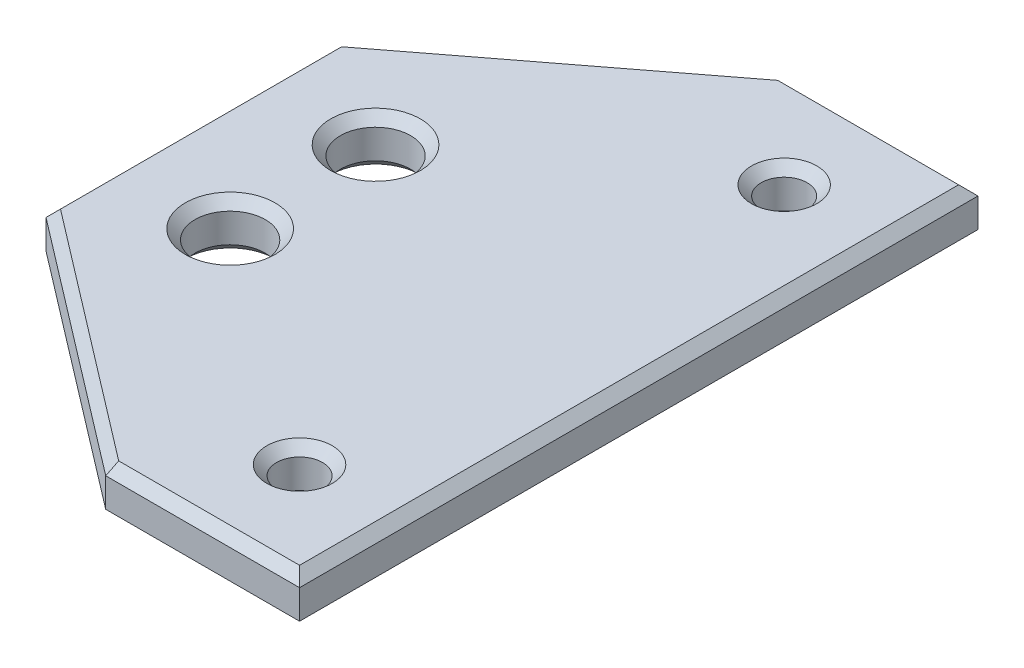
ISO-10303-21;
HEADER;
FILE_DESCRIPTION(('STEP AP214'),'2;1');
FILE_NAME('part.step','',(''),(''),'','','');
FILE_SCHEMA(('AUTOMOTIVE_DESIGN { 1 0 10303 214 1 1 1 1 }'));
ENDSEC;
DATA;
#1=APPLICATION_CONTEXT('core data for automotive mechanical design processes');
#2=APPLICATION_PROTOCOL_DEFINITION('international standard','automotive_design',2000,#1);
#3=PRODUCT_CONTEXT('',#1,'mechanical');
#4=PRODUCT('Part','Part','',(#3));
#5=PRODUCT_RELATED_PRODUCT_CATEGORY('part','',(#4));
#6=PRODUCT_DEFINITION_FORMATION('','',#4);
#7=PRODUCT_DEFINITION_CONTEXT('part definition',#1,'design');
#8=PRODUCT_DEFINITION('design','',#6,#7);
#9=PRODUCT_DEFINITION_SHAPE('','',#8);
#10=(LENGTH_UNIT() NAMED_UNIT(*) SI_UNIT(.MILLI.,.METRE.));
#11=(NAMED_UNIT(*) PLANE_ANGLE_UNIT() SI_UNIT($,.RADIAN.));
#12=(NAMED_UNIT(*) SI_UNIT($,.STERADIAN.) SOLID_ANGLE_UNIT());
#13=UNCERTAINTY_MEASURE_WITH_UNIT(LENGTH_MEASURE(1.E-05),#10,'distance_accuracy_value','');
#14=(GEOMETRIC_REPRESENTATION_CONTEXT(3) GLOBAL_UNCERTAINTY_ASSIGNED_CONTEXT((#13)) GLOBAL_UNIT_ASSIGNED_CONTEXT((#10,
#11,#12)) REPRESENTATION_CONTEXT('',''));
#15=CARTESIAN_POINT('',(0.,0.,0.));
#16=DIRECTION('',(0.,0.,1.));
#17=DIRECTION('',(1.,0.,0.));
#18=AXIS2_PLACEMENT_3D('',#15,#16,#17);
#19=CARTESIAN_POINT('',(0.,0.,0.));
#20=DIRECTION('',(0.,1.,0.));
#21=DIRECTION('',(0.,0.,1.));
#22=AXIS2_PLACEMENT_3D('',#19,#20,#21);
#23=PLANE('',#22);
#24=DIRECTION('',(0.,0.,-1.));
#25=VECTOR('',#24,1.);
#26=CARTESIAN_POINT('',(-22.0809330836494,0.,0.));
#27=LINE('',#26,#25);
#28=CARTESIAN_POINT('',(-22.0809330836494,0.,14.505735342258));
#29=VERTEX_POINT('',#28);
#30=CARTESIAN_POINT('',(-22.0809330836494,0.,-14.505735342258));
#31=VERTEX_POINT('',#30);
#32=EDGE_CURVE('E203',#29,#31,#27,.T.);
#33=ORIENTED_EDGE('',*,*,#32,.T.);
#34=DIRECTION('',(0.794447689767019,0.,-0.607332584523379));
#35=VECTOR('',#34,1.);
#36=CARTESIAN_POINT('',(-15.1435453150859,0.,-19.8091702915851));
#37=LINE('',#36,#35);
#38=CARTESIAN_POINT('',(3.41938406663806,0.,-34.));
#39=VERTEX_POINT('',#38);
#40=EDGE_CURVE('E205',#31,#39,#37,.T.);
#41=ORIENTED_EDGE('',*,*,#40,.T.);
#42=DIRECTION('',(1.,0.,0.));
#43=VECTOR('',#42,1.);
#44=CARTESIAN_POINT('',(0.,0.,-34.));
#45=LINE('',#44,#43);
#46=CARTESIAN_POINT('',(22.0809330836494,0.,-34.));
#47=VERTEX_POINT('',#46);
#48=EDGE_CURVE('E195',#39,#47,#45,.T.);
#49=ORIENTED_EDGE('',*,*,#48,.T.);
#50=DIRECTION('',(0.,0.,1.));
#51=VECTOR('',#50,1.);
#52=CARTESIAN_POINT('',(22.0809330836494,0.,35.));
#53=LINE('',#52,#51);
#54=CARTESIAN_POINT('',(22.0809330836494,0.,34.));
#55=VERTEX_POINT('',#54);
#56=EDGE_CURVE('E197',#47,#55,#53,.T.);
#57=ORIENTED_EDGE('',*,*,#56,.T.);
#58=DIRECTION('',(-1.,0.,0.));
#59=VECTOR('',#58,1.);
#60=CARTESIAN_POINT('',(3.08093308364943,0.,34.));
#61=LINE('',#60,#59);
#62=CARTESIAN_POINT('',(3.41938406663809,0.,34.));
#63=VERTEX_POINT('',#62);
#64=EDGE_CURVE('E199',#55,#63,#61,.T.);
#65=ORIENTED_EDGE('',*,*,#64,.T.);
#66=DIRECTION('',(-0.794447689767018,0.,-0.607332584523379));
#67=VECTOR('',#66,1.);
#68=CARTESIAN_POINT('',(-15.1435453150859,0.,19.8091702915851));
#69=LINE('',#68,#67);
#70=EDGE_CURVE('E201',#63,#29,#69,.T.);
#71=ORIENTED_EDGE('',*,*,#70,.T.);
#72=EDGE_LOOP('',(#33,#41,#49,#57,#65,#71));
#73=FACE_BOUND('',#72,.T.);
#74=CARTESIAN_POINT('',(-11.5809330836494,0.,7.5));
#75=DIRECTION('',(0.,1.,0.));
#76=DIRECTION('',(0.,0.,1.));
#77=AXIS2_PLACEMENT_3D('',#74,#75,#76);
#78=CIRCLE('',#77,4.62499999999999);
#79=CARTESIAN_POINT('',(-11.5809330836494,0.,12.125));
#80=VERTEX_POINT('',#79);
#81=EDGE_CURVE('E208',#80,#80,#78,.T.);
#82=ORIENTED_EDGE('',*,*,#81,.T.);
#83=EDGE_LOOP('',(#82));
#84=FACE_BOUND('',#83,.T.);
#85=CARTESIAN_POINT('',(-11.5809330836494,0.,-7.5));
#86=DIRECTION('',(0.,1.,0.));
#87=DIRECTION('',(0.,0.,1.));
#88=AXIS2_PLACEMENT_3D('',#85,#86,#87);
#89=CIRCLE('',#88,4.62499999999999);
#90=CARTESIAN_POINT('',(-11.5809330836494,0.,-2.87500000000001));
#91=VERTEX_POINT('',#90);
#92=EDGE_CURVE('E211',#91,#91,#89,.T.);
#93=ORIENTED_EDGE('',*,*,#92,.T.);
#94=EDGE_LOOP('',(#93));
#95=FACE_BOUND('',#94,.T.);
#96=CARTESIAN_POINT('',(13.0809330836494,0.,25.));
#97=DIRECTION('',(0.,1.,0.));
#98=DIRECTION('',(0.,0.,1.));
#99=AXIS2_PLACEMENT_3D('',#96,#97,#98);
#100=CIRCLE('',#99,3.37499999999999);
#101=CARTESIAN_POINT('',(13.0809330836494,0.,28.375));
#102=VERTEX_POINT('',#101);
#103=EDGE_CURVE('E214',#102,#102,#100,.T.);
#104=ORIENTED_EDGE('',*,*,#103,.T.);
#105=EDGE_LOOP('',(#104));
#106=FACE_BOUND('',#105,.T.);
#107=CARTESIAN_POINT('',(13.0809330836494,0.,-25.));
#108=DIRECTION('',(0.,1.,0.));
#109=DIRECTION('',(0.,0.,1.));
#110=AXIS2_PLACEMENT_3D('',#107,#108,#109);
#111=CIRCLE('',#110,3.37499999999999);
#112=CARTESIAN_POINT('',(13.0809330836494,0.,-21.625));
#113=VERTEX_POINT('',#112);
#114=EDGE_CURVE('E217',#113,#113,#111,.T.);
#115=ORIENTED_EDGE('',*,*,#114,.T.);
#116=EDGE_LOOP('',(#115));
#117=FACE_BOUND('',#116,.T.);
#118=DIRECTION('',(0.,0.,1.));
#119=VECTOR('',#118,1.);
#120=CARTESIAN_POINT('',(16.0809330836494,0.,17.));
#121=LINE('',#120,#119);
#122=CARTESIAN_POINT('',(16.0809330836494,0.,-17.));
#123=VERTEX_POINT('',#122);
#124=CARTESIAN_POINT('',(16.0809330836494,0.,17.));
#125=VERTEX_POINT('',#124);
#126=EDGE_CURVE('E167',#123,#125,#121,.T.);
#127=ORIENTED_EDGE('',*,*,#126,.F.);
#128=DIRECTION('',(1.,0.,0.));
#129=VECTOR('',#128,1.);
#130=CARTESIAN_POINT('',(10.0809330836494,0.,-17.));
#131=LINE('',#130,#129);
#132=CARTESIAN_POINT('',(10.0809330836494,0.,-17.));
#133=VERTEX_POINT('',#132);
#134=EDGE_CURVE('E164',#133,#123,#131,.T.);
#135=ORIENTED_EDGE('',*,*,#134,.F.);
#136=DIRECTION('',(0.,0.,-1.));
#137=VECTOR('',#136,1.);
#138=CARTESIAN_POINT('',(10.0809330836494,0.,17.));
#139=LINE('',#138,#137);
#140=CARTESIAN_POINT('',(10.0809330836494,0.,17.));
#141=VERTEX_POINT('',#140);
#142=EDGE_CURVE('E54',#141,#133,#139,.T.);
#143=ORIENTED_EDGE('',*,*,#142,.F.);
#144=DIRECTION('',(-1.,0.,0.));
#145=VECTOR('',#144,1.);
#146=CARTESIAN_POINT('',(10.0809330836494,0.,17.));
#147=LINE('',#146,#145);
#148=EDGE_CURVE('E49',#125,#141,#147,.T.);
#149=ORIENTED_EDGE('',*,*,#148,.F.);
#150=EDGE_LOOP('',(#127,#135,#143,#149));
#151=FACE_BOUND('',#150,.T.);
#152=ADVANCED_FACE('F32',(#73,#84,#95,#106,#117,#151),#23,.F.);
#153=CARTESIAN_POINT('',(0.,5.,-35.));
#154=DIRECTION('',(0.,0.,1.));
#155=DIRECTION('',(1.,0.,0.));
#156=AXIS2_PLACEMENT_3D('',#153,#154,#155);
#157=PLANE('',#156);
#158=DIRECTION('',(0.,-1.,0.));
#159=VECTOR('',#158,1.);
#160=CARTESIAN_POINT('',(23.0809330836494,5.,-35.));
#161=LINE('',#160,#159);
#162=CARTESIAN_POINT('',(23.0809330836494,4.,-35.));
#163=VERTEX_POINT('',#162);
#164=CARTESIAN_POINT('',(23.0809330836494,0.999999999999994,-35.));
#165=VERTEX_POINT('',#164);
#166=EDGE_CURVE('E176',#163,#165,#161,.T.);
#167=ORIENTED_EDGE('',*,*,#166,.T.);
#168=DIRECTION('',(-1.,0.,0.));
#169=VECTOR('',#168,1.);
#170=CARTESIAN_POINT('',(0.,0.999999999999994,-35.));
#171=LINE('',#170,#169);
#172=CARTESIAN_POINT('',(3.08093308364943,0.999999999999994,-35.));
#173=VERTEX_POINT('',#172);
#174=EDGE_CURVE('E268',#165,#173,#171,.T.);
#175=ORIENTED_EDGE('',*,*,#174,.T.);
#176=DIRECTION('',(0.,-1.,0.));
#177=VECTOR('',#176,1.);
#178=CARTESIAN_POINT('',(3.08093308364943,5.,-35.));
#179=LINE('',#178,#177);
#180=CARTESIAN_POINT('',(3.08093308364943,4.,-35.));
#181=VERTEX_POINT('',#180);
#182=EDGE_CURVE('E192',#181,#173,#179,.T.);
#183=ORIENTED_EDGE('',*,*,#182,.F.);
#184=DIRECTION('',(1.,0.,0.));
#185=VECTOR('',#184,1.);
#186=CARTESIAN_POINT('',(23.0809330836494,4.,-35.));
#187=LINE('',#186,#185);
#188=EDGE_CURVE('E266',#181,#163,#187,.T.);
#189=ORIENTED_EDGE('',*,*,#188,.T.);
#190=EDGE_LOOP('',(#167,#175,#183,#189));
#191=FACE_BOUND('',#190,.T.);
#192=ADVANCED_FACE('F341',(#191),#157,.F.);
#193=CARTESIAN_POINT('',(-15.7508778996093,5.,-20.6036179813521));
#194=DIRECTION('',(0.607332584523379,0.,0.794447689767018));
#195=DIRECTION('',(0.794447689767018,0.,-0.607332584523379));
#196=AXIS2_PLACEMENT_3D('',#193,#194,#195);
#197=PLANE('',#196);
#198=ORIENTED_EDGE('',*,*,#182,.T.);
#199=DIRECTION('',(-0.794447689767018,0.,0.607332584523379));
#200=VECTOR('',#199,1.);
#201=CARTESIAN_POINT('',(-15.7508778996093,0.999999999999994,-20.6036179813521));
#202=LINE('',#201,#200);
#203=CARTESIAN_POINT('',(-23.0809330836494,0.999999999999994,-15.));
#204=VERTEX_POINT('',#203);
#205=EDGE_CURVE('E246',#173,#204,#202,.T.);
#206=ORIENTED_EDGE('',*,*,#205,.T.);
#207=DIRECTION('',(0.,-1.,0.));
#208=VECTOR('',#207,1.);
#209=CARTESIAN_POINT('',(-23.0809330836494,5.,-15.));
#210=LINE('',#209,#208);
#211=CARTESIAN_POINT('',(-23.0809330836494,4.,-15.));
#212=VERTEX_POINT('',#211);
#213=EDGE_CURVE('E189',#212,#204,#210,.T.);
#214=ORIENTED_EDGE('',*,*,#213,.F.);
#215=DIRECTION('',(0.794447689767018,0.,-0.607332584523379));
#216=VECTOR('',#215,1.);
#217=CARTESIAN_POINT('',(3.08093308364943,4.,-35.));
#218=LINE('',#217,#216);
#219=EDGE_CURVE('E244',#212,#181,#218,.T.);
#220=ORIENTED_EDGE('',*,*,#219,.T.);
#221=EDGE_LOOP('',(#198,#206,#214,#220));
#222=FACE_BOUND('',#221,.T.);
#223=ADVANCED_FACE('F358',(#222),#197,.F.);
#224=CARTESIAN_POINT('',(-23.0809330836494,5.,0.));
#225=DIRECTION('',(1.,0.,0.));
#226=DIRECTION('',(0.,0.,-1.));
#227=AXIS2_PLACEMENT_3D('',#224,#225,#226);
#228=PLANE('',#227);
#229=ORIENTED_EDGE('',*,*,#213,.T.);
#230=DIRECTION('',(0.,0.,1.));
#231=VECTOR('',#230,1.);
#232=CARTESIAN_POINT('',(-23.0809330836494,0.999999999999994,0.));
#233=LINE('',#232,#231);
#234=CARTESIAN_POINT('',(-23.0809330836494,0.999999999999995,15.));
#235=VERTEX_POINT('',#234);
#236=EDGE_CURVE('E251',#204,#235,#233,.T.);
#237=ORIENTED_EDGE('',*,*,#236,.T.);
#238=DIRECTION('',(0.,-1.,0.));
#239=VECTOR('',#238,1.);
#240=CARTESIAN_POINT('',(-23.0809330836494,5.,15.));
#241=LINE('',#240,#239);
#242=CARTESIAN_POINT('',(-23.0809330836494,4.,15.));
#243=VERTEX_POINT('',#242);
#244=EDGE_CURVE('E186',#243,#235,#241,.T.);
#245=ORIENTED_EDGE('',*,*,#244,.F.);
#246=DIRECTION('',(0.,0.,-1.));
#247=VECTOR('',#246,1.);
#248=CARTESIAN_POINT('',(-23.0809330836494,4.,-15.));
#249=LINE('',#248,#247);
#250=EDGE_CURVE('E249',#243,#212,#249,.T.);
#251=ORIENTED_EDGE('',*,*,#250,.T.);
#252=EDGE_LOOP('',(#229,#237,#245,#251));
#253=FACE_BOUND('',#252,.T.);
#254=ADVANCED_FACE('F361',(#253),#228,.F.);
#255=CARTESIAN_POINT('',(-15.7508778996092,5.,20.6036179813521));
#256=DIRECTION('',(0.607332584523379,0.,-0.794447689767018));
#257=DIRECTION('',(-0.794447689767018,0.,-0.607332584523379));
#258=AXIS2_PLACEMENT_3D('',#255,#256,#257);
#259=PLANE('',#258);
#260=ORIENTED_EDGE('',*,*,#244,.T.);
#261=DIRECTION('',(0.794447689767018,0.,0.607332584523379));
#262=VECTOR('',#261,1.);
#263=CARTESIAN_POINT('',(-15.7508778996092,0.999999999999995,20.6036179813521));
#264=LINE('',#263,#262);
#265=CARTESIAN_POINT('',(3.08093308364943,0.999999999999994,35.));
#266=VERTEX_POINT('',#265);
#267=EDGE_CURVE('E255',#235,#266,#264,.T.);
#268=ORIENTED_EDGE('',*,*,#267,.T.);
#269=DIRECTION('',(0.,-1.,0.));
#270=VECTOR('',#269,1.);
#271=CARTESIAN_POINT('',(3.08093308364943,5.,35.));
#272=LINE('',#271,#270);
#273=CARTESIAN_POINT('',(3.08093308364943,4.,35.));
#274=VERTEX_POINT('',#273);
#275=EDGE_CURVE('E183',#274,#266,#272,.T.);
#276=ORIENTED_EDGE('',*,*,#275,.F.);
#277=DIRECTION('',(-0.794447689767018,0.,-0.607332584523379));
#278=VECTOR('',#277,1.);
#279=CARTESIAN_POINT('',(-23.0809330836494,4.,15.));
#280=LINE('',#279,#278);
#281=EDGE_CURVE('E253',#274,#243,#280,.T.);
#282=ORIENTED_EDGE('',*,*,#281,.T.);
#283=EDGE_LOOP('',(#260,#268,#276,#282));
#284=FACE_BOUND('',#283,.T.);
#285=ADVANCED_FACE('F366',(#284),#259,.F.);
#286=CARTESIAN_POINT('',(0.,5.,35.));
#287=DIRECTION('',(0.,0.,1.));
#288=DIRECTION('',(1.,0.,0.));
#289=AXIS2_PLACEMENT_3D('',#286,#287,#288);
#290=PLANE('',#289);
#291=ORIENTED_EDGE('',*,*,#275,.T.);
#292=DIRECTION('',(1.,0.,0.));
#293=VECTOR('',#292,1.);
#294=CARTESIAN_POINT('',(23.0809330836494,0.999999999999994,35.));
#295=LINE('',#294,#293);
#296=CARTESIAN_POINT('',(23.0809330836494,0.999999999999994,35.));
#297=VERTEX_POINT('',#296);
#298=EDGE_CURVE('E259',#266,#297,#295,.T.);
#299=ORIENTED_EDGE('',*,*,#298,.T.);
#300=DIRECTION('',(0.,-1.,0.));
#301=VECTOR('',#300,1.);
#302=CARTESIAN_POINT('',(23.0809330836494,5.,35.));
#303=LINE('',#302,#301);
#304=CARTESIAN_POINT('',(23.0809330836494,4.,35.));
#305=VERTEX_POINT('',#304);
#306=EDGE_CURVE('E179',#305,#297,#303,.T.);
#307=ORIENTED_EDGE('',*,*,#306,.F.);
#308=DIRECTION('',(-1.,0.,0.));
#309=VECTOR('',#308,1.);
#310=CARTESIAN_POINT('',(0.,4.,35.));
#311=LINE('',#310,#309);
#312=EDGE_CURVE('E257',#305,#274,#311,.T.);
#313=ORIENTED_EDGE('',*,*,#312,.T.);
#314=EDGE_LOOP('',(#291,#299,#307,#313));
#315=FACE_BOUND('',#314,.T.);
#316=ADVANCED_FACE('F387',(#315),#290,.T.);
#317=CARTESIAN_POINT('',(13.0809330836494,5.,25.));
#318=DIRECTION('',(0.,-1.,0.));
#319=DIRECTION('',(0.,0.,-1.));
#320=AXIS2_PLACEMENT_3D('',#317,#318,#319);
#321=CYLINDRICAL_SURFACE('',#320,2.375);
#322=CARTESIAN_POINT('',(13.0809330836494,0.999999999999992,25.));
#323=DIRECTION('',(0.,1.,0.));
#324=DIRECTION('',(0.,0.,1.));
#325=AXIS2_PLACEMENT_3D('',#322,#323,#324);
#326=CIRCLE('',#325,2.375);
#327=CARTESIAN_POINT('',(13.0809330836494,0.999999999999992,27.375));
#328=VERTEX_POINT('',#327);
#329=EDGE_CURVE('E229',#328,#328,#326,.F.);
#330=ORIENTED_EDGE('',*,*,#329,.T.);
#331=EDGE_LOOP('',(#330));
#332=FACE_BOUND('',#331,.T.);
#333=CARTESIAN_POINT('',(13.0809330836494,4.00000000000001,25.));
#334=DIRECTION('',(0.,1.,0.));
#335=DIRECTION('',(0.,0.,1.));
#336=AXIS2_PLACEMENT_3D('',#333,#334,#335);
#337=CIRCLE('',#336,2.375);
#338=CARTESIAN_POINT('',(13.0809330836494,4.00000000000001,27.375));
#339=VERTEX_POINT('',#338);
#340=EDGE_CURVE('E226',#339,#339,#337,.T.);
#341=ORIENTED_EDGE('',*,*,#340,.T.);
#342=EDGE_LOOP('',(#341));
#343=FACE_BOUND('',#342,.T.);
#344=ADVANCED_FACE('F417',(#332,#343),#321,.F.);
#345=CARTESIAN_POINT('',(-11.5809330836494,5.,-7.5));
#346=DIRECTION('',(0.,-1.,0.));
#347=DIRECTION('',(0.,0.,-1.));
#348=AXIS2_PLACEMENT_3D('',#345,#346,#347);
#349=CYLINDRICAL_SURFACE('',#348,3.625);
#350=CARTESIAN_POINT('',(-11.5809330836494,1.,-7.5));
#351=DIRECTION('',(0.,1.,0.));
#352=DIRECTION('',(0.,0.,1.));
#353=AXIS2_PLACEMENT_3D('',#350,#351,#352);
#354=CIRCLE('',#353,3.625);
#355=CARTESIAN_POINT('',(-11.5809330836494,1.,-3.875));
#356=VERTEX_POINT('',#355);
#357=EDGE_CURVE('E235',#356,#356,#354,.F.);
#358=ORIENTED_EDGE('',*,*,#357,.T.);
#359=EDGE_LOOP('',(#358));
#360=FACE_BOUND('',#359,.T.);
#361=CARTESIAN_POINT('',(-11.5809330836494,4.,-7.5));
#362=DIRECTION('',(0.,1.,0.));
#363=DIRECTION('',(0.,0.,1.));
#364=AXIS2_PLACEMENT_3D('',#361,#362,#363);
#365=CIRCLE('',#364,3.625);
#366=CARTESIAN_POINT('',(-11.5809330836494,4.,-3.875));
#367=VERTEX_POINT('',#366);
#368=EDGE_CURVE('E232',#367,#367,#365,.T.);
#369=ORIENTED_EDGE('',*,*,#368,.T.);
#370=EDGE_LOOP('',(#369));
#371=FACE_BOUND('',#370,.T.);
#372=ADVANCED_FACE('F420',(#360,#371),#349,.F.);
#373=CARTESIAN_POINT('',(-11.5809330836494,5.,7.5));
#374=DIRECTION('',(0.,-1.,0.));
#375=DIRECTION('',(0.,0.,-1.));
#376=AXIS2_PLACEMENT_3D('',#373,#374,#375);
#377=CYLINDRICAL_SURFACE('',#376,3.625);
#378=CARTESIAN_POINT('',(-11.5809330836494,0.999999999999999,7.5));
#379=DIRECTION('',(0.,1.,0.));
#380=DIRECTION('',(0.,0.,1.));
#381=AXIS2_PLACEMENT_3D('',#378,#379,#380);
#382=CIRCLE('',#381,3.625);
#383=CARTESIAN_POINT('',(-11.5809330836494,0.999999999999999,11.125));
#384=VERTEX_POINT('',#383);
#385=EDGE_CURVE('E241',#384,#384,#382,.F.);
#386=ORIENTED_EDGE('',*,*,#385,.T.);
#387=EDGE_LOOP('',(#386));
#388=FACE_BOUND('',#387,.T.);
#389=CARTESIAN_POINT('',(-11.5809330836494,4.,7.5));
#390=DIRECTION('',(0.,1.,0.));
#391=DIRECTION('',(0.,0.,1.));
#392=AXIS2_PLACEMENT_3D('',#389,#390,#391);
#393=CIRCLE('',#392,3.625);
#394=CARTESIAN_POINT('',(-11.5809330836494,4.,11.125));
#395=VERTEX_POINT('',#394);
#396=EDGE_CURVE('E238',#395,#395,#393,.T.);
#397=ORIENTED_EDGE('',*,*,#396,.T.);
#398=EDGE_LOOP('',(#397));
#399=FACE_BOUND('',#398,.T.);
#400=ADVANCED_FACE('F424',(#388,#399),#377,.F.);
#401=CARTESIAN_POINT('',(23.0809330836494,5.,0.));
#402=DIRECTION('',(1.,0.,0.));
#403=DIRECTION('',(0.,0.,-1.));
#404=AXIS2_PLACEMENT_3D('',#401,#402,#403);
#405=PLANE('',#404);
#406=ORIENTED_EDGE('',*,*,#306,.T.);
#407=DIRECTION('',(0.,0.,-1.));
#408=VECTOR('',#407,1.);
#409=CARTESIAN_POINT('',(23.0809330836494,0.999999999999994,-35.));
#410=LINE('',#409,#408);
#411=EDGE_CURVE('E264',#297,#165,#410,.T.);
#412=ORIENTED_EDGE('',*,*,#411,.T.);
#413=ORIENTED_EDGE('',*,*,#166,.F.);
#414=DIRECTION('',(0.,0.,1.));
#415=VECTOR('',#414,1.);
#416=CARTESIAN_POINT('',(23.0809330836494,4.,0.));
#417=LINE('',#416,#415);
#418=EDGE_CURVE('E261',#163,#305,#417,.T.);
#419=ORIENTED_EDGE('',*,*,#418,.T.);
#420=EDGE_LOOP('',(#406,#412,#413,#419));
#421=FACE_BOUND('',#420,.T.);
#422=ADVANCED_FACE('F344',(#421),#405,.T.);
#423=CARTESIAN_POINT('',(13.0809330836494,5.,-25.));
#424=DIRECTION('',(0.,-1.,0.));
#425=DIRECTION('',(0.,0.,-1.));
#426=AXIS2_PLACEMENT_3D('',#423,#424,#425);
#427=CYLINDRICAL_SURFACE('',#426,2.375);
#428=CARTESIAN_POINT('',(13.0809330836494,0.999999999999992,-25.));
#429=DIRECTION('',(0.,1.,0.));
#430=DIRECTION('',(0.,0.,1.));
#431=AXIS2_PLACEMENT_3D('',#428,#429,#430);
#432=CIRCLE('',#431,2.375);
#433=CARTESIAN_POINT('',(13.0809330836494,0.999999999999992,-22.625));
#434=VERTEX_POINT('',#433);
#435=EDGE_CURVE('E223',#434,#434,#432,.F.);
#436=ORIENTED_EDGE('',*,*,#435,.T.);
#437=EDGE_LOOP('',(#436));
#438=FACE_BOUND('',#437,.T.);
#439=CARTESIAN_POINT('',(13.0809330836494,4.00000000000001,-25.));
#440=DIRECTION('',(0.,1.,0.));
#441=DIRECTION('',(0.,0.,1.));
#442=AXIS2_PLACEMENT_3D('',#439,#440,#441);
#443=CIRCLE('',#442,2.375);
#444=CARTESIAN_POINT('',(13.0809330836494,4.00000000000001,-22.625));
#445=VERTEX_POINT('',#444);
#446=EDGE_CURVE('E220',#445,#445,#443,.T.);
#447=ORIENTED_EDGE('',*,*,#446,.T.);
#448=EDGE_LOOP('',(#447));
#449=FACE_BOUND('',#448,.T.);
#450=ADVANCED_FACE('F413',(#438,#449),#427,.F.);
#451=CARTESIAN_POINT('',(0.,5.,0.));
#452=DIRECTION('',(0.,1.,0.));
#453=DIRECTION('',(0.,0.,1.));
#454=AXIS2_PLACEMENT_3D('',#451,#452,#453);
#455=PLANE('',#454);
#456=CARTESIAN_POINT('',(13.0809330836494,5.,-25.));
#457=DIRECTION('',(0.,1.,0.));
#458=DIRECTION('',(0.,0.,1.));
#459=AXIS2_PLACEMENT_3D('',#456,#457,#458);
#460=CIRCLE('',#459,3.375);
#461=CARTESIAN_POINT('',(13.0809330836494,5.,-21.625));
#462=VERTEX_POINT('',#461);
#463=EDGE_CURVE('E11',#462,#462,#460,.F.);
#464=ORIENTED_EDGE('',*,*,#463,.T.);
#465=EDGE_LOOP('',(#464));
#466=FACE_BOUND('',#465,.T.);
#467=CARTESIAN_POINT('',(13.0809330836494,5.,25.));
#468=DIRECTION('',(0.,1.,0.));
#469=DIRECTION('',(0.,0.,1.));
#470=AXIS2_PLACEMENT_3D('',#467,#468,#469);
#471=CIRCLE('',#470,3.375);
#472=CARTESIAN_POINT('',(13.0809330836494,5.,28.375));
#473=VERTEX_POINT('',#472);
#474=EDGE_CURVE('E41',#473,#473,#471,.F.);
#475=ORIENTED_EDGE('',*,*,#474,.T.);
#476=EDGE_LOOP('',(#475));
#477=FACE_BOUND('',#476,.T.);
#478=CARTESIAN_POINT('',(-11.5809330836494,5.,-7.5));
#479=DIRECTION('',(0.,1.,0.));
#480=DIRECTION('',(0.,0.,1.));
#481=AXIS2_PLACEMENT_3D('',#478,#479,#480);
#482=CIRCLE('',#481,4.625);
#483=CARTESIAN_POINT('',(-11.5809330836494,5.,-2.875));
#484=VERTEX_POINT('',#483);
#485=EDGE_CURVE('E286',#484,#484,#482,.F.);
#486=ORIENTED_EDGE('',*,*,#485,.T.);
#487=EDGE_LOOP('',(#486));
#488=FACE_BOUND('',#487,.T.);
#489=CARTESIAN_POINT('',(-11.5809330836494,5.,7.5));
#490=DIRECTION('',(0.,1.,0.));
#491=DIRECTION('',(0.,0.,1.));
#492=AXIS2_PLACEMENT_3D('',#489,#490,#491);
#493=CIRCLE('',#492,4.625);
#494=CARTESIAN_POINT('',(-11.5809330836494,5.,12.125));
#495=VERTEX_POINT('',#494);
#496=EDGE_CURVE('E283',#495,#495,#493,.F.);
#497=ORIENTED_EDGE('',*,*,#496,.T.);
#498=EDGE_LOOP('',(#497));
#499=FACE_BOUND('',#498,.T.);
#500=DIRECTION('',(1.,0.,0.));
#501=VECTOR('',#500,1.);
#502=CARTESIAN_POINT('',(0.,5.,34.));
#503=LINE('',#502,#501);
#504=CARTESIAN_POINT('',(3.41938406663809,5.,34.));
#505=VERTEX_POINT('',#504);
#506=CARTESIAN_POINT('',(22.0809330836494,5.,34.));
#507=VERTEX_POINT('',#506);
#508=EDGE_CURVE('E278',#505,#507,#503,.T.);
#509=ORIENTED_EDGE('',*,*,#508,.T.);
#510=DIRECTION('',(0.,0.,-1.));
#511=VECTOR('',#510,1.);
#512=CARTESIAN_POINT('',(22.0809330836494,5.,0.));
#513=LINE('',#512,#511);
#514=CARTESIAN_POINT('',(22.0809330836494,5.,-34.));
#515=VERTEX_POINT('',#514);
#516=EDGE_CURVE('E280',#507,#515,#513,.T.);
#517=ORIENTED_EDGE('',*,*,#516,.T.);
#518=DIRECTION('',(-1.,0.,0.));
#519=VECTOR('',#518,1.);
#520=CARTESIAN_POINT('',(3.08093308364942,5.,-34.));
#521=LINE('',#520,#519);
#522=CARTESIAN_POINT('',(3.41938406663807,5.,-34.));
#523=VERTEX_POINT('',#522);
#524=EDGE_CURVE('E270',#515,#523,#521,.T.);
#525=ORIENTED_EDGE('',*,*,#524,.T.);
#526=DIRECTION('',(-0.794447689767019,0.,0.607332584523379));
#527=VECTOR('',#526,1.);
#528=CARTESIAN_POINT('',(-22.4736004991261,5.,-14.205552310233));
#529=LINE('',#528,#527);
#530=CARTESIAN_POINT('',(-22.0809330836494,5.,-14.505735342258));
#531=VERTEX_POINT('',#530);
#532=EDGE_CURVE('E272',#523,#531,#529,.T.);
#533=ORIENTED_EDGE('',*,*,#532,.T.);
#534=DIRECTION('',(0.,0.,1.));
#535=VECTOR('',#534,1.);
#536=CARTESIAN_POINT('',(-22.0809330836494,5.,15.));
#537=LINE('',#536,#535);
#538=CARTESIAN_POINT('',(-22.0809330836494,5.,14.505735342258));
#539=VERTEX_POINT('',#538);
#540=EDGE_CURVE('E274',#531,#539,#537,.T.);
#541=ORIENTED_EDGE('',*,*,#540,.T.);
#542=DIRECTION('',(0.794447689767018,0.,0.607332584523379));
#543=VECTOR('',#542,1.);
#544=CARTESIAN_POINT('',(3.6882656681728,5.,34.205552310233));
#545=LINE('',#544,#543);
#546=EDGE_CURVE('E276',#539,#505,#545,.T.);
#547=ORIENTED_EDGE('',*,*,#546,.T.);
#548=EDGE_LOOP('',(#509,#517,#525,#533,#541,#547));
#549=FACE_BOUND('',#548,.T.);
#550=ADVANCED_FACE('F329',(#466,#477,#488,#499,#549),#455,.T.);
#551=CARTESIAN_POINT('',(13.0809330836494,0.,-25.));
#552=DIRECTION('',(0.,-1.,0.));
#553=DIRECTION('',(0.,0.,-1.));
#554=AXIS2_PLACEMENT_3D('',#551,#552,#553);
#555=CONICAL_SURFACE('',#554,3.37499999999999,0.785398163397446);
#556=ORIENTED_EDGE('',*,*,#435,.F.);
#557=EDGE_LOOP('',(#556));
#558=FACE_BOUND('',#557,.T.);
#559=ORIENTED_EDGE('',*,*,#114,.F.);
#560=EDGE_LOOP('',(#559));
#561=FACE_BOUND('',#560,.T.);
#562=ADVANCED_FACE('F439',(#558,#561),#555,.F.);
#563=CARTESIAN_POINT('',(13.0809330836494,0.,25.));
#564=DIRECTION('',(0.,-1.,0.));
#565=DIRECTION('',(0.,0.,-1.));
#566=AXIS2_PLACEMENT_3D('',#563,#564,#565);
#567=CONICAL_SURFACE('',#566,3.37499999999999,0.785398163397446);
#568=ORIENTED_EDGE('',*,*,#329,.F.);
#569=EDGE_LOOP('',(#568));
#570=FACE_BOUND('',#569,.T.);
#571=ORIENTED_EDGE('',*,*,#103,.F.);
#572=EDGE_LOOP('',(#571));
#573=FACE_BOUND('',#572,.T.);
#574=ADVANCED_FACE('F442',(#570,#573),#567,.F.);
#575=CARTESIAN_POINT('',(-11.5809330836494,0.,-7.5));
#576=DIRECTION('',(0.,-1.,0.));
#577=DIRECTION('',(0.,0.,-1.));
#578=AXIS2_PLACEMENT_3D('',#575,#576,#577);
#579=CONICAL_SURFACE('',#578,4.62499999999999,0.785398163397444);
#580=ORIENTED_EDGE('',*,*,#357,.F.);
#581=EDGE_LOOP('',(#580));
#582=FACE_BOUND('',#581,.T.);
#583=ORIENTED_EDGE('',*,*,#92,.F.);
#584=EDGE_LOOP('',(#583));
#585=FACE_BOUND('',#584,.T.);
#586=ADVANCED_FACE('F446',(#582,#585),#579,.F.);
#587=CARTESIAN_POINT('',(-11.5809330836494,0.,7.5));
#588=DIRECTION('',(0.,-1.,0.));
#589=DIRECTION('',(0.,0.,-1.));
#590=AXIS2_PLACEMENT_3D('',#587,#588,#589);
#591=CONICAL_SURFACE('',#590,4.62499999999999,0.785398163397444);
#592=ORIENTED_EDGE('',*,*,#385,.F.);
#593=EDGE_LOOP('',(#592));
#594=FACE_BOUND('',#593,.T.);
#595=ORIENTED_EDGE('',*,*,#81,.F.);
#596=EDGE_LOOP('',(#595));
#597=FACE_BOUND('',#596,.T.);
#598=ADVANCED_FACE('F450',(#594,#597),#591,.F.);
#599=CARTESIAN_POINT('',(0.,0.,34.));
#600=DIRECTION('',(0.,-0.70710678118655,0.707106781186545));
#601=DIRECTION('',(1.,0.,0.));
#602=AXIS2_PLACEMENT_3D('',#599,#600,#601);
#603=PLANE('',#602);
#604=DIRECTION('',(-0.232748502870771,0.687687477860186,0.687687477860191));
#605=VECTOR('',#604,1.);
#606=CARTESIAN_POINT('',(3.23414965258442,0.547300564524807,34.5473005645248));
#607=LINE('',#606,#605);
#608=EDGE_CURVE('E301',#63,#266,#607,.T.);
#609=ORIENTED_EDGE('',*,*,#608,.F.);
#610=ORIENTED_EDGE('',*,*,#64,.F.);
#611=DIRECTION('',(-0.577350269189627,-0.577350269189623,-0.577350269189627));
#612=VECTOR('',#611,1.);
#613=CARTESIAN_POINT('',(10.7475997503161,-11.3333333333333,22.6666666666666));
#614=LINE('',#613,#612);
#615=EDGE_CURVE('E180',#297,#55,#614,.T.);
#616=ORIENTED_EDGE('',*,*,#615,.F.);
#617=ORIENTED_EDGE('',*,*,#298,.F.);
#618=EDGE_LOOP('',(#609,#610,#616,#617));
#619=FACE_BOUND('',#618,.T.);
#620=ADVANCED_FACE('F384',(#619),#603,.T.);
#621=CARTESIAN_POINT('',(22.0809330836494,0.,0.));
#622=DIRECTION('',(0.707106781186545,-0.70710678118655,0.));
#623=DIRECTION('',(0.,0.,-1.));
#624=AXIS2_PLACEMENT_3D('',#621,#622,#623);
#625=PLANE('',#624);
#626=ORIENTED_EDGE('',*,*,#615,.T.);
#627=ORIENTED_EDGE('',*,*,#56,.F.);
#628=DIRECTION('',(0.577350269189627,0.577350269189623,-0.577350269189627));
#629=VECTOR('',#628,1.);
#630=CARTESIAN_POINT('',(15.3872887224329,-6.69364436121646,-27.3063556387835));
#631=LINE('',#630,#629);
#632=EDGE_CURVE('E298',#165,#47,#631,.F.);
#633=ORIENTED_EDGE('',*,*,#632,.F.);
#634=ORIENTED_EDGE('',*,*,#411,.F.);
#635=EDGE_LOOP('',(#626,#627,#633,#634));
#636=FACE_BOUND('',#635,.T.);
#637=ADVANCED_FACE('F349',(#636),#625,.T.);
#638=CARTESIAN_POINT('',(-15.7508778996092,0.999999999999994,20.6036179813521));
#639=DIRECTION('',(0.429448988952033,0.707106781186549,-0.561759348732244));
#640=DIRECTION('',(0.794447689767018,0.,0.607332584523379));
#641=AXIS2_PLACEMENT_3D('',#638,#639,#640);
#642=PLANE('',#641);
#643=ORIENTED_EDGE('',*,*,#608,.T.);
#644=ORIENTED_EDGE('',*,*,#267,.F.);
#645=DIRECTION('',(0.667513083015658,-0.667513083015653,-0.329928125515041));
#646=VECTOR('',#645,1.);
#647=CARTESIAN_POINT('',(-21.0489454550375,-1.03198762861194,13.9956603302081));
#648=LINE('',#647,#646);
#649=EDGE_CURVE('E295',#29,#235,#648,.F.);
#650=ORIENTED_EDGE('',*,*,#649,.F.);
#651=ORIENTED_EDGE('',*,*,#70,.F.);
#652=EDGE_LOOP('',(#643,#644,#650,#651));
#653=FACE_BOUND('',#652,.T.);
#654=ADVANCED_FACE('F370',(#653),#642,.F.);
#655=CARTESIAN_POINT('',(0.,0.999999999999994,-35.));
#656=DIRECTION('',(0.,0.70710678118655,0.707106781186545));
#657=DIRECTION('',(-1.,0.,0.));
#658=AXIS2_PLACEMENT_3D('',#655,#656,#657);
#659=PLANE('',#658);
#660=ORIENTED_EDGE('',*,*,#632,.T.);
#661=ORIENTED_EDGE('',*,*,#48,.F.);
#662=DIRECTION('',(-0.232748502870768,0.687687477860187,-0.687687477860191));
#663=VECTOR('',#662,1.);
#664=CARTESIAN_POINT('',(2.91403319075454,1.49312869893621,-35.4931286989362));
#665=LINE('',#664,#663);
#666=EDGE_CURVE('E293',#173,#39,#665,.F.);
#667=ORIENTED_EDGE('',*,*,#666,.F.);
#668=ORIENTED_EDGE('',*,*,#174,.F.);
#669=EDGE_LOOP('',(#660,#661,#667,#668));
#670=FACE_BOUND('',#669,.T.);
#671=ADVANCED_FACE('F355',(#670),#659,.F.);
#672=CARTESIAN_POINT('',(-23.0809330836494,0.999999999999994,0.));
#673=DIRECTION('',(0.707106781186545,0.70710678118655,0.));
#674=DIRECTION('',(0.,0.,1.));
#675=AXIS2_PLACEMENT_3D('',#672,#673,#674);
#676=PLANE('',#675);
#677=ORIENTED_EDGE('',*,*,#649,.T.);
#678=ORIENTED_EDGE('',*,*,#236,.F.);
#679=DIRECTION('',(0.667513083015659,-0.667513083015654,0.329928125515039));
#680=VECTOR('',#679,1.);
#681=CARTESIAN_POINT('',(-19.7774629801076,-2.3034701035418,-13.367211479912));
#682=LINE('',#681,#680);
#683=EDGE_CURVE('E291',#31,#204,#682,.F.);
#684=ORIENTED_EDGE('',*,*,#683,.F.);
#685=ORIENTED_EDGE('',*,*,#32,.F.);
#686=EDGE_LOOP('',(#677,#678,#684,#685));
#687=FACE_BOUND('',#686,.T.);
#688=ADVANCED_FACE('F375',(#687),#676,.F.);
#689=CARTESIAN_POINT('',(-15.7508778996093,0.999999999999994,-20.6036179813521));
#690=DIRECTION('',(0.429448988952033,0.707106781186548,0.561759348732245));
#691=DIRECTION('',(-0.794447689767018,0.,0.607332584523379));
#692=AXIS2_PLACEMENT_3D('',#689,#690,#691);
#693=PLANE('',#692);
#694=ORIENTED_EDGE('',*,*,#666,.T.);
#695=ORIENTED_EDGE('',*,*,#40,.F.);
#696=ORIENTED_EDGE('',*,*,#683,.T.);
#697=ORIENTED_EDGE('',*,*,#205,.F.);
#698=EDGE_LOOP('',(#694,#695,#696,#697));
#699=FACE_BOUND('',#698,.T.);
#700=ADVANCED_FACE('F381',(#699),#693,.F.);
#701=CARTESIAN_POINT('',(13.0809330836494,4.00000000000001,-25.));
#702=DIRECTION('',(0.,1.,0.));
#703=DIRECTION('',(0.,0.,1.));
#704=AXIS2_PLACEMENT_3D('',#701,#702,#703);
#705=CONICAL_SURFACE('',#704,2.375,0.785398163397455);
#706=ORIENTED_EDGE('',*,*,#463,.F.);
#707=EDGE_LOOP('',(#706));
#708=FACE_BOUND('',#707,.T.);
#709=ORIENTED_EDGE('',*,*,#446,.F.);
#710=EDGE_LOOP('',(#709));
#711=FACE_BOUND('',#710,.T.);
#712=ADVANCED_FACE('F457',(#708,#711),#705,.F.);
#713=CARTESIAN_POINT('',(13.0809330836494,4.00000000000001,25.));
#714=DIRECTION('',(0.,1.,0.));
#715=DIRECTION('',(0.,0.,1.));
#716=AXIS2_PLACEMENT_3D('',#713,#714,#715);
#717=CONICAL_SURFACE('',#716,2.375,0.785398163397455);
#718=ORIENTED_EDGE('',*,*,#474,.F.);
#719=EDGE_LOOP('',(#718));
#720=FACE_BOUND('',#719,.T.);
#721=ORIENTED_EDGE('',*,*,#340,.F.);
#722=EDGE_LOOP('',(#721));
#723=FACE_BOUND('',#722,.T.);
#724=ADVANCED_FACE('F470',(#720,#723),#717,.F.);
#725=CARTESIAN_POINT('',(-11.5809330836494,4.,-7.5));
#726=DIRECTION('',(0.,1.,0.));
#727=DIRECTION('',(0.,0.,1.));
#728=AXIS2_PLACEMENT_3D('',#725,#726,#727);
#729=CONICAL_SURFACE('',#728,3.625,0.785398163397453);
#730=ORIENTED_EDGE('',*,*,#485,.F.);
#731=EDGE_LOOP('',(#730));
#732=FACE_BOUND('',#731,.T.);
#733=ORIENTED_EDGE('',*,*,#368,.F.);
#734=EDGE_LOOP('',(#733));
#735=FACE_BOUND('',#734,.T.);
#736=ADVANCED_FACE('F474',(#732,#735),#729,.F.);
#737=CARTESIAN_POINT('',(-11.5809330836494,4.,7.5));
#738=DIRECTION('',(0.,1.,0.));
#739=DIRECTION('',(0.,0.,1.));
#740=AXIS2_PLACEMENT_3D('',#737,#738,#739);
#741=CONICAL_SURFACE('',#740,3.625,0.785398163397453);
#742=ORIENTED_EDGE('',*,*,#496,.F.);
#743=EDGE_LOOP('',(#742));
#744=FACE_BOUND('',#743,.T.);
#745=ORIENTED_EDGE('',*,*,#396,.F.);
#746=EDGE_LOOP('',(#745));
#747=FACE_BOUND('',#746,.T.);
#748=ADVANCED_FACE('F477',(#744,#747),#741,.F.);
#749=CARTESIAN_POINT('',(-22.0809330836494,5.,0.));
#750=DIRECTION('',(-0.707106781186552,0.707106781186543,0.));
#751=DIRECTION('',(0.,0.,-1.));
#752=AXIS2_PLACEMENT_3D('',#749,#750,#751);
#753=PLANE('',#752);
#754=DIRECTION('',(0.667513083015652,0.667513083015661,-0.329928125515038));
#755=VECTOR('',#754,1.);
#756=CARTESIAN_POINT('',(-18.8863155481135,8.19461753553595,12.9267487994398));
#757=LINE('',#756,#755);
#758=EDGE_CURVE('E312',#539,#243,#757,.F.);
#759=ORIENTED_EDGE('',*,*,#758,.F.);
#760=ORIENTED_EDGE('',*,*,#540,.F.);
#761=DIRECTION('',(0.667513083015652,0.667513083015661,0.329928125515036));
#762=VECTOR('',#761,1.);
#763=CARTESIAN_POINT('',(-20.1577980230434,6.92313506060608,-13.5551976497359));
#764=LINE('',#763,#762);
#765=EDGE_CURVE('E36',#212,#531,#764,.T.);
#766=ORIENTED_EDGE('',*,*,#765,.F.);
#767=ORIENTED_EDGE('',*,*,#250,.F.);
#768=EDGE_LOOP('',(#759,#760,#766,#767));
#769=FACE_BOUND('',#768,.T.);
#770=ADVANCED_FACE('F34',(#769),#753,.T.);
#771=CARTESIAN_POINT('',(-15.1435453150859,5.,-19.8091702915851));
#772=DIRECTION('',(-0.429448988952038,0.707106781186541,-0.561759348732251));
#773=DIRECTION('',(0.794447689767018,0.,-0.607332584523379));
#774=AXIS2_PLACEMENT_3D('',#771,#772,#773);
#775=PLANE('',#774);
#776=ORIENTED_EDGE('',*,*,#765,.T.);
#777=ORIENTED_EDGE('',*,*,#532,.F.);
#778=DIRECTION('',(0.232748502870766,0.687687477860194,0.687687477860185));
#779=VECTOR('',#778,1.);
#780=CARTESIAN_POINT('',(3.2341496525844,4.4526994354752,-34.5473005645248));
#781=LINE('',#780,#779);
#782=EDGE_CURVE('E310',#181,#523,#781,.T.);
#783=ORIENTED_EDGE('',*,*,#782,.F.);
#784=ORIENTED_EDGE('',*,*,#219,.F.);
#785=EDGE_LOOP('',(#776,#777,#783,#784));
#786=FACE_BOUND('',#785,.T.);
#787=ADVANCED_FACE('F323',(#786),#775,.T.);
#788=CARTESIAN_POINT('',(-15.1435453150859,5.,19.8091702915851));
#789=DIRECTION('',(-0.429448988952037,0.707106781186542,0.56175934873225));
#790=DIRECTION('',(-0.794447689767018,0.,-0.607332584523379));
#791=AXIS2_PLACEMENT_3D('',#788,#789,#790);
#792=PLANE('',#791);
#793=ORIENTED_EDGE('',*,*,#758,.T.);
#794=ORIENTED_EDGE('',*,*,#281,.F.);
#795=DIRECTION('',(-0.232748502870769,-0.687687477860194,0.687687477860184));
#796=VECTOR('',#795,1.);
#797=CARTESIAN_POINT('',(4.68515464958492,8.73989335699247,30.2601066430076));
#798=LINE('',#797,#796);
#799=EDGE_CURVE('E307',#505,#274,#798,.T.);
#800=ORIENTED_EDGE('',*,*,#799,.F.);
#801=ORIENTED_EDGE('',*,*,#546,.F.);
#802=EDGE_LOOP('',(#793,#794,#800,#801));
#803=FACE_BOUND('',#802,.T.);
#804=ADVANCED_FACE('F389',(#803),#792,.T.);
#805=CARTESIAN_POINT('',(0.,5.,-34.));
#806=DIRECTION('',(0.,0.707106781186543,-0.707106781186552));
#807=DIRECTION('',(1.,0.,0.));
#808=AXIS2_PLACEMENT_3D('',#805,#806,#807);
#809=PLANE('',#808);
#810=ORIENTED_EDGE('',*,*,#782,.T.);
#811=ORIENTED_EDGE('',*,*,#524,.F.);
#812=DIRECTION('',(-0.577350269189623,0.577350269189631,0.577350269189623));
#813=VECTOR('',#812,1.);
#814=CARTESIAN_POINT('',(14.7206220557664,12.3603110278832,-26.6396889721169));
#815=LINE('',#814,#813);
#816=EDGE_CURVE('E170',#163,#515,#815,.T.);
#817=ORIENTED_EDGE('',*,*,#816,.F.);
#818=ORIENTED_EDGE('',*,*,#188,.F.);
#819=EDGE_LOOP('',(#810,#811,#817,#818));
#820=FACE_BOUND('',#819,.T.);
#821=ADVANCED_FACE('F335',(#820),#809,.T.);
#822=CARTESIAN_POINT('',(0.,4.,35.));
#823=DIRECTION('',(0.,-0.707106781186543,-0.707106781186552));
#824=DIRECTION('',(-1.,0.,0.));
#825=AXIS2_PLACEMENT_3D('',#822,#823,#824);
#826=PLANE('',#825);
#827=ORIENTED_EDGE('',*,*,#799,.T.);
#828=ORIENTED_EDGE('',*,*,#312,.F.);
#829=DIRECTION('',(-0.577350269189623,0.577350269189631,-0.577350269189623));
#830=VECTOR('',#829,1.);
#831=CARTESIAN_POINT('',(15.387288722433,11.6936443612165,27.3063556387836));
#832=LINE('',#831,#830);
#833=EDGE_CURVE('E168',#507,#305,#832,.F.);
#834=ORIENTED_EDGE('',*,*,#833,.F.);
#835=ORIENTED_EDGE('',*,*,#508,.F.);
#836=EDGE_LOOP('',(#827,#828,#834,#835));
#837=FACE_BOUND('',#836,.T.);
#838=ADVANCED_FACE('F392',(#837),#826,.F.);
#839=CARTESIAN_POINT('',(23.0809330836494,4.,0.));
#840=DIRECTION('',(-0.707106781186552,-0.707106781186543,0.));
#841=DIRECTION('',(0.,0.,1.));
#842=AXIS2_PLACEMENT_3D('',#839,#840,#841);
#843=PLANE('',#842);
#844=ORIENTED_EDGE('',*,*,#816,.T.);
#845=ORIENTED_EDGE('',*,*,#516,.F.);
#846=ORIENTED_EDGE('',*,*,#833,.T.);
#847=ORIENTED_EDGE('',*,*,#418,.F.);
#848=EDGE_LOOP('',(#844,#845,#846,#847));
#849=FACE_BOUND('',#848,.T.);
#850=ADVANCED_FACE('F395',(#849),#843,.F.);
#851=CARTESIAN_POINT('',(16.0809330836494,-2.,17.));
#852=DIRECTION('',(-1.,0.,0.));
#853=DIRECTION('',(0.,0.,1.));
#854=AXIS2_PLACEMENT_3D('',#851,#852,#853);
#855=PLANE('',#854);
#856=ORIENTED_EDGE('',*,*,#126,.T.);
#857=DIRECTION('',(0.,1.,0.));
#858=VECTOR('',#857,1.);
#859=CARTESIAN_POINT('',(16.0809330836494,-2.,17.));
#860=LINE('',#859,#858);
#861=CARTESIAN_POINT('',(16.0809330836494,-2.,17.));
#862=VERTEX_POINT('',#861);
#863=EDGE_CURVE('E148',#862,#125,#860,.T.);
#864=ORIENTED_EDGE('',*,*,#863,.F.);
#865=DIRECTION('',(0.,0.,1.));
#866=VECTOR('',#865,1.);
#867=CARTESIAN_POINT('',(16.0809330836494,-2.,17.));
#868=LINE('',#867,#866);
#869=CARTESIAN_POINT('',(16.0809330836494,-2.,-17.));
#870=VERTEX_POINT('',#869);
#871=EDGE_CURVE('E155',#870,#862,#868,.T.);
#872=ORIENTED_EDGE('',*,*,#871,.F.);
#873=DIRECTION('',(0.,1.,0.));
#874=VECTOR('',#873,1.);
#875=CARTESIAN_POINT('',(16.0809330836494,-2.,-17.));
#876=LINE('',#875,#874);
#877=EDGE_CURVE('E658',#870,#123,#876,.T.);
#878=ORIENTED_EDGE('',*,*,#877,.T.);
#879=EDGE_LOOP('',(#856,#864,#872,#878));
#880=FACE_BOUND('',#879,.T.);
#881=ADVANCED_FACE('F166',(#880),#855,.F.);
#882=CARTESIAN_POINT('',(10.0809330836494,-2.,17.));
#883=DIRECTION('',(0.,0.,-1.));
#884=DIRECTION('',(-1.,0.,0.));
#885=AXIS2_PLACEMENT_3D('',#882,#883,#884);
#886=PLANE('',#885);
#887=ORIENTED_EDGE('',*,*,#148,.T.);
#888=DIRECTION('',(0.,1.,0.));
#889=VECTOR('',#888,1.);
#890=CARTESIAN_POINT('',(10.0809330836494,-2.,17.));
#891=LINE('',#890,#889);
#892=CARTESIAN_POINT('',(10.0809330836494,-2.,17.));
#893=VERTEX_POINT('',#892);
#894=EDGE_CURVE('E151',#893,#141,#891,.T.);
#895=ORIENTED_EDGE('',*,*,#894,.F.);
#896=DIRECTION('',(-1.,0.,0.));
#897=VECTOR('',#896,1.);
#898=CARTESIAN_POINT('',(10.0809330836494,-2.,17.));
#899=LINE('',#898,#897);
#900=EDGE_CURVE('E144',#862,#893,#899,.T.);
#901=ORIENTED_EDGE('',*,*,#900,.F.);
#902=ORIENTED_EDGE('',*,*,#863,.T.);
#903=EDGE_LOOP('',(#887,#895,#901,#902));
#904=FACE_BOUND('',#903,.T.);
#905=ADVANCED_FACE('F146',(#904),#886,.F.);
#906=CARTESIAN_POINT('',(10.0809330836494,-2.,17.));
#907=DIRECTION('',(1.,0.,0.));
#908=DIRECTION('',(0.,0.,-1.));
#909=AXIS2_PLACEMENT_3D('',#906,#907,#908);
#910=PLANE('',#909);
#911=ORIENTED_EDGE('',*,*,#142,.T.);
#912=DIRECTION('',(0.,1.,0.));
#913=VECTOR('',#912,1.);
#914=CARTESIAN_POINT('',(10.0809330836494,-2.,-17.));
#915=LINE('',#914,#913);
#916=CARTESIAN_POINT('',(10.0809330836494,-2.,-17.));
#917=VERTEX_POINT('',#916);
#918=EDGE_CURVE('E172',#917,#133,#915,.T.);
#919=ORIENTED_EDGE('',*,*,#918,.F.);
#920=DIRECTION('',(0.,0.,-1.));
#921=VECTOR('',#920,1.);
#922=CARTESIAN_POINT('',(10.0809330836494,-2.,17.));
#923=LINE('',#922,#921);
#924=EDGE_CURVE('E154',#893,#917,#923,.T.);
#925=ORIENTED_EDGE('',*,*,#924,.F.);
#926=ORIENTED_EDGE('',*,*,#894,.T.);
#927=EDGE_LOOP('',(#911,#919,#925,#926));
#928=FACE_BOUND('',#927,.T.);
#929=ADVANCED_FACE('F625',(#928),#910,.F.);
#930=CARTESIAN_POINT('',(10.0809330836494,-2.,-17.));
#931=DIRECTION('',(0.,0.,1.));
#932=DIRECTION('',(1.,0.,0.));
#933=AXIS2_PLACEMENT_3D('',#930,#931,#932);
#934=PLANE('',#933);
#935=ORIENTED_EDGE('',*,*,#134,.T.);
#936=ORIENTED_EDGE('',*,*,#877,.F.);
#937=DIRECTION('',(1.,0.,0.));
#938=VECTOR('',#937,1.);
#939=CARTESIAN_POINT('',(10.0809330836494,-2.,-17.));
#940=LINE('',#939,#938);
#941=EDGE_CURVE('E160',#917,#870,#940,.T.);
#942=ORIENTED_EDGE('',*,*,#941,.F.);
#943=ORIENTED_EDGE('',*,*,#918,.T.);
#944=EDGE_LOOP('',(#935,#936,#942,#943));
#945=FACE_BOUND('',#944,.T.);
#946=ADVANCED_FACE('F634',(#945),#934,.F.);
#947=CARTESIAN_POINT('',(0.,-2.,0.));
#948=DIRECTION('',(0.,-1.,0.));
#949=DIRECTION('',(0.,0.,-1.));
#950=AXIS2_PLACEMENT_3D('',#947,#948,#949);
#951=PLANE('',#950);
#952=ORIENTED_EDGE('',*,*,#871,.T.);
#953=ORIENTED_EDGE('',*,*,#900,.T.);
#954=ORIENTED_EDGE('',*,*,#924,.T.);
#955=ORIENTED_EDGE('',*,*,#941,.T.);
#956=EDGE_LOOP('',(#952,#953,#954,#955));
#957=FACE_BOUND('',#956,.T.);
#958=ADVANCED_FACE('F158',(#957),#951,.T.);
#959=CLOSED_SHELL('',(#152,#192,#223,#254,#285,#316,#344,#372,#400,#422,#450,#550,#562,#574,
#586,#598,#620,#637,#654,#671,#688,#700,#712,#724,#736,#748,#770,#787,#804,#821,#838,#850,#881,
#905,#929,#946,#958));
#960=MANIFOLD_SOLID_BREP('B2',#959);
#961=ADVANCED_BREP_SHAPE_REPRESENTATION('',(#18,#960),#14);
#962=SHAPE_DEFINITION_REPRESENTATION(#9,#961);
ENDSEC;
END-ISO-10303-21;
